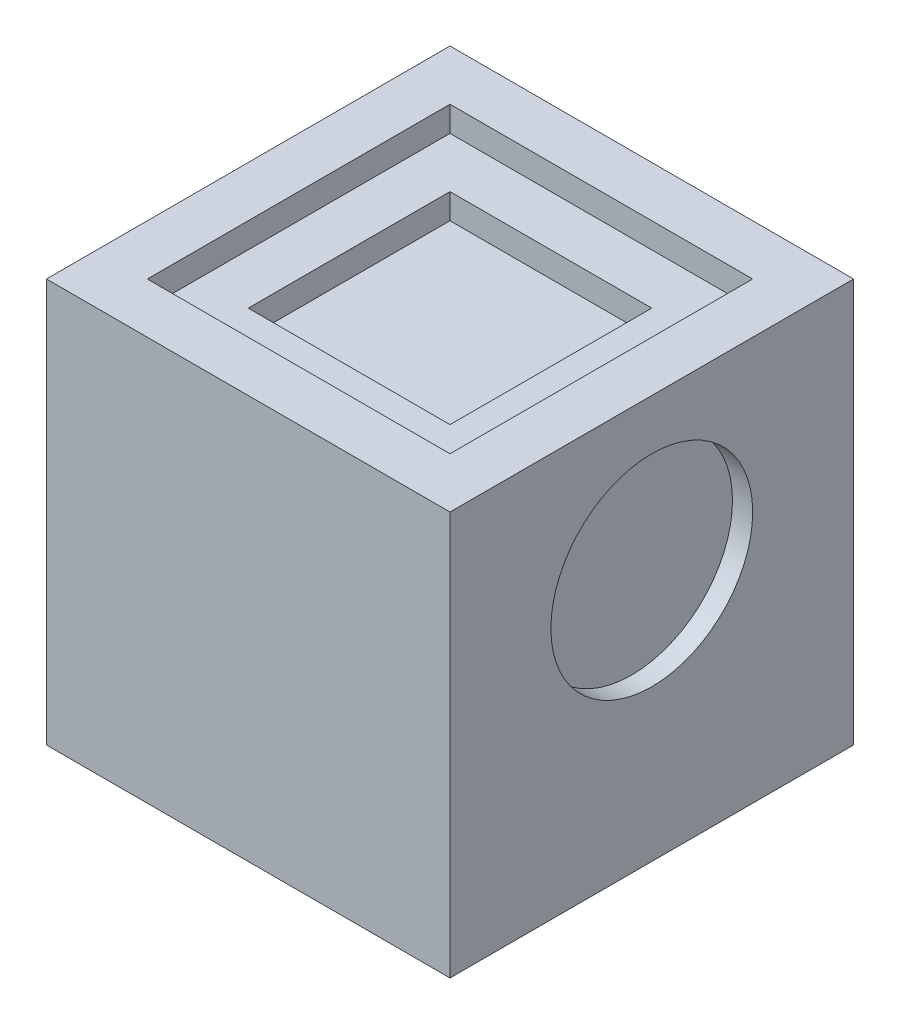
ISO-10303-21;
HEADER;
FILE_DESCRIPTION(('STEP AP214'),'2;1');
FILE_NAME('part.step','',(''),(''),'','','');
FILE_SCHEMA(('AUTOMOTIVE_DESIGN { 1 0 10303 214 1 1 1 1 }'));
ENDSEC;
DATA;
#1=APPLICATION_CONTEXT('core data for automotive mechanical design processes');
#2=APPLICATION_PROTOCOL_DEFINITION('international standard','automotive_design',2000,#1);
#3=PRODUCT_CONTEXT('',#1,'mechanical');
#4=PRODUCT('Part','Part','',(#3));
#5=PRODUCT_RELATED_PRODUCT_CATEGORY('part','',(#4));
#6=PRODUCT_DEFINITION_FORMATION('','',#4);
#7=PRODUCT_DEFINITION_CONTEXT('part definition',#1,'design');
#8=PRODUCT_DEFINITION('design','',#6,#7);
#9=PRODUCT_DEFINITION_SHAPE('','',#8);
#10=(LENGTH_UNIT() NAMED_UNIT(*) SI_UNIT(.MILLI.,.METRE.));
#11=(NAMED_UNIT(*) PLANE_ANGLE_UNIT() SI_UNIT($,.RADIAN.));
#12=(NAMED_UNIT(*) SI_UNIT($,.STERADIAN.) SOLID_ANGLE_UNIT());
#13=UNCERTAINTY_MEASURE_WITH_UNIT(LENGTH_MEASURE(1.E-05),#10,'distance_accuracy_value','');
#14=(GEOMETRIC_REPRESENTATION_CONTEXT(3) GLOBAL_UNCERTAINTY_ASSIGNED_CONTEXT((#13)) GLOBAL_UNIT_ASSIGNED_CONTEXT((#10,
#11,#12)) REPRESENTATION_CONTEXT('',''));
#15=CARTESIAN_POINT('',(0.,0.,0.));
#16=DIRECTION('',(0.,0.,1.));
#17=DIRECTION('',(1.,0.,0.));
#18=AXIS2_PLACEMENT_3D('',#15,#16,#17);
#19=CARTESIAN_POINT('',(0.,47.625,0.));
#20=DIRECTION('',(0.,-1.,0.));
#21=DIRECTION('',(0.,0.,-1.));
#22=AXIS2_PLACEMENT_3D('',#19,#20,#21);
#23=PLANE('',#22);
#24=DIRECTION('',(0.,0.,-1.));
#25=VECTOR('',#24,1.);
#26=CARTESIAN_POINT('',(19.05,47.625,19.05));
#27=LINE('',#26,#25);
#28=CARTESIAN_POINT('',(19.05,47.625,19.05));
#29=VERTEX_POINT('',#28);
#30=CARTESIAN_POINT('',(19.05,47.625,-19.05));
#31=VERTEX_POINT('',#30);
#32=EDGE_CURVE('E181',#29,#31,#27,.T.);
#33=ORIENTED_EDGE('',*,*,#32,.T.);
#34=DIRECTION('',(-1.,0.,0.));
#35=VECTOR('',#34,1.);
#36=CARTESIAN_POINT('',(-19.05,47.625,-19.05));
#37=LINE('',#36,#35);
#38=CARTESIAN_POINT('',(-19.05,47.625,-19.05));
#39=VERTEX_POINT('',#38);
#40=EDGE_CURVE('E185',#31,#39,#37,.T.);
#41=ORIENTED_EDGE('',*,*,#40,.T.);
#42=DIRECTION('',(0.,0.,1.));
#43=VECTOR('',#42,1.);
#44=CARTESIAN_POINT('',(-19.05,47.625,19.05));
#45=LINE('',#44,#43);
#46=CARTESIAN_POINT('',(-19.05,47.625,19.05));
#47=VERTEX_POINT('',#46);
#48=EDGE_CURVE('E190',#39,#47,#45,.T.);
#49=ORIENTED_EDGE('',*,*,#48,.T.);
#50=DIRECTION('',(1.,0.,0.));
#51=VECTOR('',#50,1.);
#52=CARTESIAN_POINT('',(-19.05,47.625,19.05));
#53=LINE('',#52,#51);
#54=EDGE_CURVE('E194',#47,#29,#53,.T.);
#55=ORIENTED_EDGE('',*,*,#54,.T.);
#56=EDGE_LOOP('',(#33,#41,#49,#55));
#57=FACE_BOUND('',#56,.T.);
#58=DIRECTION('',(0.,0.,-1.));
#59=VECTOR('',#58,1.);
#60=CARTESIAN_POINT('',(12.7,47.625,12.7));
#61=LINE('',#60,#59);
#62=CARTESIAN_POINT('',(12.7,47.625,12.7));
#63=VERTEX_POINT('',#62);
#64=CARTESIAN_POINT('',(12.7,47.625,-12.7));
#65=VERTEX_POINT('',#64);
#66=EDGE_CURVE('E136',#63,#65,#61,.T.);
#67=ORIENTED_EDGE('',*,*,#66,.F.);
#68=DIRECTION('',(1.,0.,0.));
#69=VECTOR('',#68,1.);
#70=CARTESIAN_POINT('',(-12.7,47.625,12.7));
#71=LINE('',#70,#69);
#72=CARTESIAN_POINT('',(-12.7,47.625,12.7));
#73=VERTEX_POINT('',#72);
#74=EDGE_CURVE('E156',#73,#63,#71,.T.);
#75=ORIENTED_EDGE('',*,*,#74,.F.);
#76=DIRECTION('',(0.,0.,1.));
#77=VECTOR('',#76,1.);
#78=CARTESIAN_POINT('',(-12.7,47.625,12.7));
#79=LINE('',#78,#77);
#80=CARTESIAN_POINT('',(-12.7,47.625,-12.7));
#81=VERTEX_POINT('',#80);
#82=EDGE_CURVE('E55',#81,#73,#79,.T.);
#83=ORIENTED_EDGE('',*,*,#82,.F.);
#84=DIRECTION('',(-1.,0.,0.));
#85=VECTOR('',#84,1.);
#86=CARTESIAN_POINT('',(-12.7,47.625,-12.7));
#87=LINE('',#86,#85);
#88=EDGE_CURVE('E168',#65,#81,#87,.T.);
#89=ORIENTED_EDGE('',*,*,#88,.F.);
#90=EDGE_LOOP('',(#67,#75,#83,#89));
#91=FACE_BOUND('',#90,.T.);
#92=ADVANCED_FACE('F39',(#57,#91),#23,.F.);
#93=CARTESIAN_POINT('',(25.4,50.8,25.4));
#94=DIRECTION('',(-1.,0.,0.));
#95=DIRECTION('',(0.,0.,1.));
#96=AXIS2_PLACEMENT_3D('',#93,#94,#95);
#97=PLANE('',#96);
#98=CARTESIAN_POINT('',(25.4,31.75,0.));
#99=DIRECTION('',(1.,0.,0.));
#100=DIRECTION('',(0.,0.,-1.));
#101=AXIS2_PLACEMENT_3D('',#98,#99,#100);
#102=CIRCLE('',#101,12.7);
#103=CARTESIAN_POINT('',(25.4,31.75,-12.7));
#104=VERTEX_POINT('',#103);
#105=EDGE_CURVE('E215',#104,#104,#102,.T.);
#106=ORIENTED_EDGE('',*,*,#105,.F.);
#107=EDGE_LOOP('',(#106));
#108=FACE_BOUND('',#107,.T.);
#109=DIRECTION('',(0.,0.,-1.));
#110=VECTOR('',#109,1.);
#111=CARTESIAN_POINT('',(25.4,0.,25.4));
#112=LINE('',#111,#110);
#113=CARTESIAN_POINT('',(25.4,0.,25.4));
#114=VERTEX_POINT('',#113);
#115=CARTESIAN_POINT('',(25.4,0.,-25.4));
#116=VERTEX_POINT('',#115);
#117=EDGE_CURVE('E228',#114,#116,#112,.T.);
#118=ORIENTED_EDGE('',*,*,#117,.T.);
#119=DIRECTION('',(0.,-1.,0.));
#120=VECTOR('',#119,1.);
#121=CARTESIAN_POINT('',(25.4,50.8,-25.4));
#122=LINE('',#121,#120);
#123=CARTESIAN_POINT('',(25.4,50.8,-25.4));
#124=VERTEX_POINT('',#123);
#125=EDGE_CURVE('E11',#124,#116,#122,.T.);
#126=ORIENTED_EDGE('',*,*,#125,.F.);
#127=DIRECTION('',(0.,0.,-1.));
#128=VECTOR('',#127,1.);
#129=CARTESIAN_POINT('',(25.4,50.8,25.4));
#130=LINE('',#129,#128);
#131=CARTESIAN_POINT('',(25.4,50.8,25.4));
#132=VERTEX_POINT('',#131);
#133=EDGE_CURVE('E232',#132,#124,#130,.T.);
#134=ORIENTED_EDGE('',*,*,#133,.F.);
#135=DIRECTION('',(0.,-1.,0.));
#136=VECTOR('',#135,1.);
#137=CARTESIAN_POINT('',(25.4,50.8,25.4));
#138=LINE('',#137,#136);
#139=EDGE_CURVE('E246',#132,#114,#138,.T.);
#140=ORIENTED_EDGE('',*,*,#139,.T.);
#141=EDGE_LOOP('',(#118,#126,#134,#140));
#142=FACE_BOUND('',#141,.T.);
#143=ADVANCED_FACE('F41',(#108,#142),#97,.F.);
#144=CARTESIAN_POINT('',(-25.4,50.8,-25.4));
#145=DIRECTION('',(0.,0.,1.));
#146=DIRECTION('',(1.,0.,0.));
#147=AXIS2_PLACEMENT_3D('',#144,#145,#146);
#148=PLANE('',#147);
#149=DIRECTION('',(-1.,0.,0.));
#150=VECTOR('',#149,1.);
#151=CARTESIAN_POINT('',(-25.4,0.,-25.4));
#152=LINE('',#151,#150);
#153=CARTESIAN_POINT('',(-25.4,0.,-25.4));
#154=VERTEX_POINT('',#153);
#155=EDGE_CURVE('E250',#116,#154,#152,.T.);
#156=ORIENTED_EDGE('',*,*,#155,.T.);
#157=DIRECTION('',(0.,-1.,0.));
#158=VECTOR('',#157,1.);
#159=CARTESIAN_POINT('',(-25.4,50.8,-25.4));
#160=LINE('',#159,#158);
#161=CARTESIAN_POINT('',(-25.4,50.8,-25.4));
#162=VERTEX_POINT('',#161);
#163=EDGE_CURVE('E48',#162,#154,#160,.T.);
#164=ORIENTED_EDGE('',*,*,#163,.F.);
#165=DIRECTION('',(-1.,0.,0.));
#166=VECTOR('',#165,1.);
#167=CARTESIAN_POINT('',(-25.4,50.8,-25.4));
#168=LINE('',#167,#166);
#169=EDGE_CURVE('E236',#124,#162,#168,.T.);
#170=ORIENTED_EDGE('',*,*,#169,.F.);
#171=ORIENTED_EDGE('',*,*,#125,.T.);
#172=EDGE_LOOP('',(#156,#164,#170,#171));
#173=FACE_BOUND('',#172,.T.);
#174=ADVANCED_FACE('F286',(#173),#148,.F.);
#175=CARTESIAN_POINT('',(-25.4,50.8,25.4));
#176=DIRECTION('',(1.,0.,0.));
#177=DIRECTION('',(0.,0.,-1.));
#178=AXIS2_PLACEMENT_3D('',#175,#176,#177);
#179=PLANE('',#178);
#180=DIRECTION('',(0.,0.,1.));
#181=VECTOR('',#180,1.);
#182=CARTESIAN_POINT('',(-25.4,0.,25.4));
#183=LINE('',#182,#181);
#184=CARTESIAN_POINT('',(-25.4,0.,25.4));
#185=VERTEX_POINT('',#184);
#186=EDGE_CURVE('E253',#154,#185,#183,.T.);
#187=ORIENTED_EDGE('',*,*,#186,.T.);
#188=DIRECTION('',(0.,-1.,0.));
#189=VECTOR('',#188,1.);
#190=CARTESIAN_POINT('',(-25.4,50.8,25.4));
#191=LINE('',#190,#189);
#192=CARTESIAN_POINT('',(-25.4,50.8,25.4));
#193=VERTEX_POINT('',#192);
#194=EDGE_CURVE('E261',#193,#185,#191,.T.);
#195=ORIENTED_EDGE('',*,*,#194,.F.);
#196=DIRECTION('',(0.,0.,1.));
#197=VECTOR('',#196,1.);
#198=CARTESIAN_POINT('',(-25.4,50.8,25.4));
#199=LINE('',#198,#197);
#200=EDGE_CURVE('E240',#162,#193,#199,.T.);
#201=ORIENTED_EDGE('',*,*,#200,.F.);
#202=ORIENTED_EDGE('',*,*,#163,.T.);
#203=EDGE_LOOP('',(#187,#195,#201,#202));
#204=FACE_BOUND('',#203,.T.);
#205=ADVANCED_FACE('F270',(#204),#179,.F.);
#206=CARTESIAN_POINT('',(-25.4,50.8,25.4));
#207=DIRECTION('',(0.,0.,-1.));
#208=DIRECTION('',(-1.,0.,0.));
#209=AXIS2_PLACEMENT_3D('',#206,#207,#208);
#210=PLANE('',#209);
#211=DIRECTION('',(1.,0.,0.));
#212=VECTOR('',#211,1.);
#213=CARTESIAN_POINT('',(-25.4,0.,25.4));
#214=LINE('',#213,#212);
#215=EDGE_CURVE('E237',#185,#114,#214,.T.);
#216=ORIENTED_EDGE('',*,*,#215,.T.);
#217=ORIENTED_EDGE('',*,*,#139,.F.);
#218=DIRECTION('',(1.,0.,0.));
#219=VECTOR('',#218,1.);
#220=CARTESIAN_POINT('',(-25.4,50.8,25.4));
#221=LINE('',#220,#219);
#222=EDGE_CURVE('E243',#193,#132,#221,.T.);
#223=ORIENTED_EDGE('',*,*,#222,.F.);
#224=ORIENTED_EDGE('',*,*,#194,.T.);
#225=EDGE_LOOP('',(#216,#217,#223,#224));
#226=FACE_BOUND('',#225,.T.);
#227=ADVANCED_FACE('F279',(#226),#210,.F.);
#228=CARTESIAN_POINT('',(0.,50.8,0.));
#229=DIRECTION('',(0.,-1.,0.));
#230=DIRECTION('',(0.,0.,-1.));
#231=AXIS2_PLACEMENT_3D('',#228,#229,#230);
#232=PLANE('',#231);
#233=DIRECTION('',(-1.,0.,0.));
#234=VECTOR('',#233,1.);
#235=CARTESIAN_POINT('',(-19.05,50.8,-19.05));
#236=LINE('',#235,#234);
#237=CARTESIAN_POINT('',(19.05,50.8,-19.05));
#238=VERTEX_POINT('',#237);
#239=CARTESIAN_POINT('',(-19.05,50.8,-19.05));
#240=VERTEX_POINT('',#239);
#241=EDGE_CURVE('E201',#238,#240,#236,.T.);
#242=ORIENTED_EDGE('',*,*,#241,.F.);
#243=DIRECTION('',(0.,0.,-1.));
#244=VECTOR('',#243,1.);
#245=CARTESIAN_POINT('',(19.05,50.8,19.05));
#246=LINE('',#245,#244);
#247=CARTESIAN_POINT('',(19.05,50.8,19.05));
#248=VERTEX_POINT('',#247);
#249=EDGE_CURVE('E63',#248,#238,#246,.T.);
#250=ORIENTED_EDGE('',*,*,#249,.F.);
#251=DIRECTION('',(1.,0.,0.));
#252=VECTOR('',#251,1.);
#253=CARTESIAN_POINT('',(-19.05,50.8,19.05));
#254=LINE('',#253,#252);
#255=CARTESIAN_POINT('',(-19.05,50.8,19.05));
#256=VERTEX_POINT('',#255);
#257=EDGE_CURVE('E186',#256,#248,#254,.T.);
#258=ORIENTED_EDGE('',*,*,#257,.F.);
#259=DIRECTION('',(0.,0.,1.));
#260=VECTOR('',#259,1.);
#261=CARTESIAN_POINT('',(-19.05,50.8,19.05));
#262=LINE('',#261,#260);
#263=EDGE_CURVE('E205',#240,#256,#262,.T.);
#264=ORIENTED_EDGE('',*,*,#263,.F.);
#265=EDGE_LOOP('',(#242,#250,#258,#264));
#266=FACE_BOUND('',#265,.T.);
#267=ORIENTED_EDGE('',*,*,#133,.T.);
#268=ORIENTED_EDGE('',*,*,#169,.T.);
#269=ORIENTED_EDGE('',*,*,#200,.T.);
#270=ORIENTED_EDGE('',*,*,#222,.T.);
#271=EDGE_LOOP('',(#267,#268,#269,#270));
#272=FACE_BOUND('',#271,.T.);
#273=ADVANCED_FACE('F285',(#266,#272),#232,.F.);
#274=CARTESIAN_POINT('',(0.,0.,0.));
#275=DIRECTION('',(0.,-1.,0.));
#276=DIRECTION('',(0.,0.,-1.));
#277=AXIS2_PLACEMENT_3D('',#274,#275,#276);
#278=PLANE('',#277);
#279=ORIENTED_EDGE('',*,*,#117,.F.);
#280=ORIENTED_EDGE('',*,*,#215,.F.);
#281=ORIENTED_EDGE('',*,*,#186,.F.);
#282=ORIENTED_EDGE('',*,*,#155,.F.);
#283=EDGE_LOOP('',(#279,#280,#281,#282));
#284=FACE_BOUND('',#283,.T.);
#285=ADVANCED_FACE('F276',(#284),#278,.T.);
#286=CARTESIAN_POINT('',(22.86,31.75,0.));
#287=DIRECTION('',(1.,0.,0.));
#288=DIRECTION('',(0.,0.,-1.));
#289=AXIS2_PLACEMENT_3D('',#286,#287,#288);
#290=CYLINDRICAL_SURFACE('',#289,12.7);
#291=CARTESIAN_POINT('',(22.86,31.75,0.));
#292=DIRECTION('',(1.,0.,0.));
#293=DIRECTION('',(0.,0.,-1.));
#294=AXIS2_PLACEMENT_3D('',#291,#292,#293);
#295=CIRCLE('',#294,12.7);
#296=CARTESIAN_POINT('',(22.86,31.75,-12.7));
#297=VERTEX_POINT('',#296);
#298=EDGE_CURVE('E224',#297,#297,#295,.T.);
#299=ORIENTED_EDGE('',*,*,#298,.F.);
#300=EDGE_LOOP('',(#299));
#301=FACE_BOUND('',#300,.T.);
#302=ORIENTED_EDGE('',*,*,#105,.T.);
#303=EDGE_LOOP('',(#302));
#304=FACE_BOUND('',#303,.T.);
#305=ADVANCED_FACE('F321',(#301,#304),#290,.F.);
#306=CARTESIAN_POINT('',(22.86,31.75,0.));
#307=DIRECTION('',(1.,0.,0.));
#308=DIRECTION('',(0.,0.,-1.));
#309=AXIS2_PLACEMENT_3D('',#306,#307,#308);
#310=PLANE('',#309);
#311=ORIENTED_EDGE('',*,*,#298,.T.);
#312=EDGE_LOOP('',(#311));
#313=FACE_BOUND('',#312,.T.);
#314=ADVANCED_FACE('F318',(#313),#310,.T.);
#315=CARTESIAN_POINT('',(19.05,47.625,19.05));
#316=DIRECTION('',(1.,0.,0.));
#317=DIRECTION('',(0.,0.,-1.));
#318=AXIS2_PLACEMENT_3D('',#315,#316,#317);
#319=PLANE('',#318);
#320=ORIENTED_EDGE('',*,*,#249,.T.);
#321=DIRECTION('',(0.,1.,0.));
#322=VECTOR('',#321,1.);
#323=CARTESIAN_POINT('',(19.05,47.625,-19.05));
#324=LINE('',#323,#322);
#325=EDGE_CURVE('E198',#31,#238,#324,.T.);
#326=ORIENTED_EDGE('',*,*,#325,.F.);
#327=ORIENTED_EDGE('',*,*,#32,.F.);
#328=DIRECTION('',(0.,1.,0.));
#329=VECTOR('',#328,1.);
#330=CARTESIAN_POINT('',(19.05,47.625,19.05));
#331=LINE('',#330,#329);
#332=EDGE_CURVE('E212',#29,#248,#331,.T.);
#333=ORIENTED_EDGE('',*,*,#332,.T.);
#334=EDGE_LOOP('',(#320,#326,#327,#333));
#335=FACE_BOUND('',#334,.T.);
#336=ADVANCED_FACE('F307',(#335),#319,.F.);
#337=CARTESIAN_POINT('',(-19.05,47.625,19.05));
#338=DIRECTION('',(0.,0.,1.));
#339=DIRECTION('',(1.,0.,0.));
#340=AXIS2_PLACEMENT_3D('',#337,#338,#339);
#341=PLANE('',#340);
#342=ORIENTED_EDGE('',*,*,#257,.T.);
#343=ORIENTED_EDGE('',*,*,#332,.F.);
#344=ORIENTED_EDGE('',*,*,#54,.F.);
#345=DIRECTION('',(0.,1.,0.));
#346=VECTOR('',#345,1.);
#347=CARTESIAN_POINT('',(-19.05,47.625,19.05));
#348=LINE('',#347,#346);
#349=EDGE_CURVE('E216',#47,#256,#348,.T.);
#350=ORIENTED_EDGE('',*,*,#349,.T.);
#351=EDGE_LOOP('',(#342,#343,#344,#350));
#352=FACE_BOUND('',#351,.T.);
#353=ADVANCED_FACE('F303',(#352),#341,.F.);
#354=CARTESIAN_POINT('',(-19.05,47.625,19.05));
#355=DIRECTION('',(-1.,0.,0.));
#356=DIRECTION('',(0.,0.,1.));
#357=AXIS2_PLACEMENT_3D('',#354,#355,#356);
#358=PLANE('',#357);
#359=ORIENTED_EDGE('',*,*,#263,.T.);
#360=ORIENTED_EDGE('',*,*,#349,.F.);
#361=ORIENTED_EDGE('',*,*,#48,.F.);
#362=DIRECTION('',(0.,1.,0.));
#363=VECTOR('',#362,1.);
#364=CARTESIAN_POINT('',(-19.05,47.625,-19.05));
#365=LINE('',#364,#363);
#366=EDGE_CURVE('E219',#39,#240,#365,.T.);
#367=ORIENTED_EDGE('',*,*,#366,.T.);
#368=EDGE_LOOP('',(#359,#360,#361,#367));
#369=FACE_BOUND('',#368,.T.);
#370=ADVANCED_FACE('F306',(#369),#358,.F.);
#371=CARTESIAN_POINT('',(-19.05,47.625,-19.05));
#372=DIRECTION('',(0.,0.,-1.));
#373=DIRECTION('',(-1.,0.,0.));
#374=AXIS2_PLACEMENT_3D('',#371,#372,#373);
#375=PLANE('',#374);
#376=ORIENTED_EDGE('',*,*,#241,.T.);
#377=ORIENTED_EDGE('',*,*,#366,.F.);
#378=ORIENTED_EDGE('',*,*,#40,.F.);
#379=ORIENTED_EDGE('',*,*,#325,.T.);
#380=EDGE_LOOP('',(#376,#377,#378,#379));
#381=FACE_BOUND('',#380,.T.);
#382=ADVANCED_FACE('F311',(#381),#375,.F.);
#383=CARTESIAN_POINT('',(12.7,44.45,12.7));
#384=DIRECTION('',(1.,0.,0.));
#385=DIRECTION('',(0.,0.,-1.));
#386=AXIS2_PLACEMENT_3D('',#383,#384,#385);
#387=PLANE('',#386);
#388=ORIENTED_EDGE('',*,*,#66,.T.);
#389=DIRECTION('',(0.,1.,0.));
#390=VECTOR('',#389,1.);
#391=CARTESIAN_POINT('',(12.7,44.45,-12.7));
#392=LINE('',#391,#390);
#393=CARTESIAN_POINT('',(12.7,44.45,-12.7));
#394=VERTEX_POINT('',#393);
#395=EDGE_CURVE('E129',#394,#65,#392,.T.);
#396=ORIENTED_EDGE('',*,*,#395,.F.);
#397=DIRECTION('',(0.,0.,-1.));
#398=VECTOR('',#397,1.);
#399=CARTESIAN_POINT('',(12.7,44.45,12.7));
#400=LINE('',#399,#398);
#401=CARTESIAN_POINT('',(12.7,44.45,12.7));
#402=VERTEX_POINT('',#401);
#403=EDGE_CURVE('E133',#402,#394,#400,.T.);
#404=ORIENTED_EDGE('',*,*,#403,.F.);
#405=DIRECTION('',(0.,1.,0.));
#406=VECTOR('',#405,1.);
#407=CARTESIAN_POINT('',(12.7,44.45,12.7));
#408=LINE('',#407,#406);
#409=EDGE_CURVE('E173',#402,#63,#408,.T.);
#410=ORIENTED_EDGE('',*,*,#409,.T.);
#411=EDGE_LOOP('',(#388,#396,#404,#410));
#412=FACE_BOUND('',#411,.T.);
#413=ADVANCED_FACE('F131',(#412),#387,.F.);
#414=CARTESIAN_POINT('',(-12.7,44.45,12.7));
#415=DIRECTION('',(0.,0.,1.));
#416=DIRECTION('',(1.,0.,0.));
#417=AXIS2_PLACEMENT_3D('',#414,#415,#416);
#418=PLANE('',#417);
#419=ORIENTED_EDGE('',*,*,#74,.T.);
#420=ORIENTED_EDGE('',*,*,#409,.F.);
#421=DIRECTION('',(1.,0.,0.));
#422=VECTOR('',#421,1.);
#423=CARTESIAN_POINT('',(-12.7,44.45,12.7));
#424=LINE('',#423,#422);
#425=CARTESIAN_POINT('',(-12.7,44.45,12.7));
#426=VERTEX_POINT('',#425);
#427=EDGE_CURVE('E142',#426,#402,#424,.T.);
#428=ORIENTED_EDGE('',*,*,#427,.F.);
#429=DIRECTION('',(0.,1.,0.));
#430=VECTOR('',#429,1.);
#431=CARTESIAN_POINT('',(-12.7,44.45,12.7));
#432=LINE('',#431,#430);
#433=EDGE_CURVE('E176',#426,#73,#432,.T.);
#434=ORIENTED_EDGE('',*,*,#433,.T.);
#435=EDGE_LOOP('',(#419,#420,#428,#434));
#436=FACE_BOUND('',#435,.T.);
#437=ADVANCED_FACE('F375',(#436),#418,.F.);
#438=CARTESIAN_POINT('',(-12.7,44.45,12.7));
#439=DIRECTION('',(-1.,0.,0.));
#440=DIRECTION('',(0.,0.,1.));
#441=AXIS2_PLACEMENT_3D('',#438,#439,#440);
#442=PLANE('',#441);
#443=ORIENTED_EDGE('',*,*,#82,.T.);
#444=ORIENTED_EDGE('',*,*,#433,.F.);
#445=DIRECTION('',(0.,0.,1.));
#446=VECTOR('',#445,1.);
#447=CARTESIAN_POINT('',(-12.7,44.45,12.7));
#448=LINE('',#447,#446);
#449=CARTESIAN_POINT('',(-12.7,44.45,-12.7));
#450=VERTEX_POINT('',#449);
#451=EDGE_CURVE('E151',#450,#426,#448,.T.);
#452=ORIENTED_EDGE('',*,*,#451,.F.);
#453=DIRECTION('',(0.,1.,0.));
#454=VECTOR('',#453,1.);
#455=CARTESIAN_POINT('',(-12.7,44.45,-12.7));
#456=LINE('',#455,#454);
#457=EDGE_CURVE('E141',#450,#81,#456,.T.);
#458=ORIENTED_EDGE('',*,*,#457,.T.);
#459=EDGE_LOOP('',(#443,#444,#452,#458));
#460=FACE_BOUND('',#459,.T.);
#461=ADVANCED_FACE('F381',(#460),#442,.F.);
#462=CARTESIAN_POINT('',(-12.7,44.45,-12.7));
#463=DIRECTION('',(0.,0.,-1.));
#464=DIRECTION('',(-1.,0.,0.));
#465=AXIS2_PLACEMENT_3D('',#462,#463,#464);
#466=PLANE('',#465);
#467=ORIENTED_EDGE('',*,*,#88,.T.);
#468=ORIENTED_EDGE('',*,*,#457,.F.);
#469=DIRECTION('',(-1.,0.,0.));
#470=VECTOR('',#469,1.);
#471=CARTESIAN_POINT('',(-12.7,44.45,-12.7));
#472=LINE('',#471,#470);
#473=EDGE_CURVE('E145',#394,#450,#472,.T.);
#474=ORIENTED_EDGE('',*,*,#473,.F.);
#475=ORIENTED_EDGE('',*,*,#395,.T.);
#476=EDGE_LOOP('',(#467,#468,#474,#475));
#477=FACE_BOUND('',#476,.T.);
#478=ADVANCED_FACE('F146',(#477),#466,.F.);
#479=CARTESIAN_POINT('',(0.,44.45,0.));
#480=DIRECTION('',(0.,-1.,0.));
#481=DIRECTION('',(0.,0.,-1.));
#482=AXIS2_PLACEMENT_3D('',#479,#480,#481);
#483=PLANE('',#482);
#484=ORIENTED_EDGE('',*,*,#403,.T.);
#485=ORIENTED_EDGE('',*,*,#473,.T.);
#486=ORIENTED_EDGE('',*,*,#451,.T.);
#487=ORIENTED_EDGE('',*,*,#427,.T.);
#488=EDGE_LOOP('',(#484,#485,#486,#487));
#489=FACE_BOUND('',#488,.T.);
#490=ADVANCED_FACE('F153',(#489),#483,.F.);
#491=CLOSED_SHELL('',(#92,#143,#174,#205,#227,#273,#285,#305,#314,#336,#353,#370,#382,#413,#437,
#461,#478,#490));
#492=MANIFOLD_SOLID_BREP('B2',#491);
#493=ADVANCED_BREP_SHAPE_REPRESENTATION('',(#18,#492),#14);
#494=SHAPE_DEFINITION_REPRESENTATION(#9,#493);
ENDSEC;
END-ISO-10303-21;
